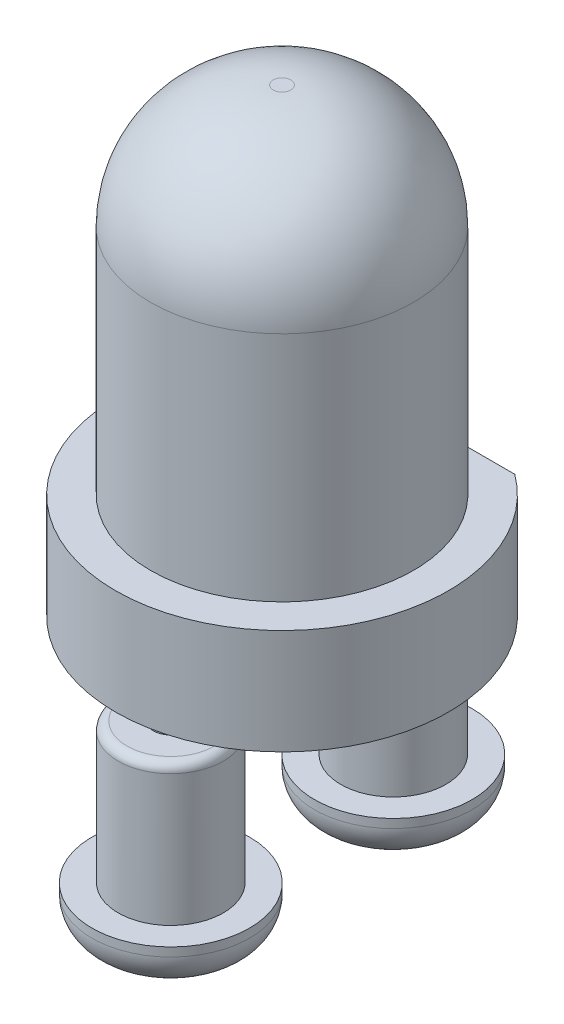
ISO-10303-21;
HEADER;
FILE_DESCRIPTION(('STEP AP214'),'2;1');
FILE_NAME('part.step','',(''),(''),'','','');
FILE_SCHEMA(('AUTOMOTIVE_DESIGN { 1 0 10303 214 1 1 1 1 }'));
ENDSEC;
DATA;
#1=APPLICATION_CONTEXT('core data for automotive mechanical design processes');
#2=APPLICATION_PROTOCOL_DEFINITION('international standard','automotive_design',2000,#1);
#3=PRODUCT_CONTEXT('',#1,'mechanical');
#4=PRODUCT('Part','Part','',(#3));
#5=PRODUCT_RELATED_PRODUCT_CATEGORY('part','',(#4));
#6=PRODUCT_DEFINITION_FORMATION('','',#4);
#7=PRODUCT_DEFINITION_CONTEXT('part definition',#1,'design');
#8=PRODUCT_DEFINITION('design','',#6,#7);
#9=PRODUCT_DEFINITION_SHAPE('','',#8);
#10=(LENGTH_UNIT() NAMED_UNIT(*) SI_UNIT(.MILLI.,.METRE.));
#11=(NAMED_UNIT(*) PLANE_ANGLE_UNIT() SI_UNIT($,.RADIAN.));
#12=(NAMED_UNIT(*) SI_UNIT($,.STERADIAN.) SOLID_ANGLE_UNIT());
#13=UNCERTAINTY_MEASURE_WITH_UNIT(LENGTH_MEASURE(1.E-05),#10,'distance_accuracy_value','');
#14=(GEOMETRIC_REPRESENTATION_CONTEXT(3) GLOBAL_UNCERTAINTY_ASSIGNED_CONTEXT((#13)) GLOBAL_UNIT_ASSIGNED_CONTEXT((#10,
#11,#12)) REPRESENTATION_CONTEXT('',''));
#15=CARTESIAN_POINT('',(0.,0.,0.));
#16=DIRECTION('',(0.,0.,1.));
#17=DIRECTION('',(1.,0.,0.));
#18=AXIS2_PLACEMENT_3D('',#15,#16,#17);
#19=CARTESIAN_POINT('',(0.,0.,0.));
#20=DIRECTION('',(0.,-1.,0.));
#21=DIRECTION('',(0.,0.,-1.));
#22=AXIS2_PLACEMENT_3D('',#19,#20,#21);
#23=PLANE('',#22);
#24=CARTESIAN_POINT('',(0.,0.,-1.27));
#25=DIRECTION('',(0.,-1.,0.));
#26=DIRECTION('',(0.,0.,-1.));
#27=AXIS2_PLACEMENT_3D('',#24,#25,#26);
#28=CIRCLE('',#27,0.2);
#29=CARTESIAN_POINT('',(0.,0.,-1.47));
#30=VERTEX_POINT('',#29);
#31=EDGE_CURVE('E174',#30,#30,#28,.T.);
#32=ORIENTED_EDGE('',*,*,#31,.F.);
#33=EDGE_LOOP('',(#32));
#34=FACE_BOUND('',#33,.T.);
#35=CARTESIAN_POINT('',(0.,0.,1.27));
#36=DIRECTION('',(0.,-1.,0.));
#37=DIRECTION('',(0.,0.,-1.));
#38=AXIS2_PLACEMENT_3D('',#35,#36,#37);
#39=CIRCLE('',#38,0.2);
#40=CARTESIAN_POINT('',(0.,0.,1.07));
#41=VERTEX_POINT('',#40);
#42=EDGE_CURVE('E177',#41,#41,#39,.T.);
#43=ORIENTED_EDGE('',*,*,#42,.F.);
#44=EDGE_LOOP('',(#43));
#45=FACE_BOUND('',#44,.T.);
#46=DIRECTION('',(1.,0.,0.));
#47=VECTOR('',#46,1.);
#48=CARTESIAN_POINT('',(-1.5,0.,-1.53));
#49=LINE('',#48,#47);
#50=CARTESIAN_POINT('',(-1.12654338576018,0.,-1.53));
#51=VERTEX_POINT('',#50);
#52=CARTESIAN_POINT('',(1.12654338576017,0.,-1.53));
#53=VERTEX_POINT('',#52);
#54=EDGE_CURVE('E59',#51,#53,#49,.T.);
#55=ORIENTED_EDGE('',*,*,#54,.T.);
#56=CARTESIAN_POINT('',(0.,0.,0.));
#57=DIRECTION('',(0.,-1.,0.));
#58=DIRECTION('',(0.,0.,-1.));
#59=AXIS2_PLACEMENT_3D('',#56,#57,#58);
#60=CIRCLE('',#59,1.9);
#61=EDGE_CURVE('E65',#53,#51,#60,.T.);
#62=ORIENTED_EDGE('',*,*,#61,.T.);
#63=EDGE_LOOP('',(#55,#62));
#64=FACE_BOUND('',#63,.T.);
#65=ADVANCED_FACE('F34',(#34,#45,#64),#23,.T.);
#66=CARTESIAN_POINT('',(0.1,5.25,0.));
#67=DIRECTION('',(0.,1.,0.));
#68=DIRECTION('',(0.,0.,1.));
#69=AXIS2_PLACEMENT_3D('',#66,#67,#68);
#70=PLANE('',#69);
#71=CARTESIAN_POINT('',(0.,5.25,0.));
#72=DIRECTION('',(0.,-1.,0.));
#73=DIRECTION('',(0.,0.,-1.));
#74=AXIS2_PLACEMENT_3D('',#71,#72,#73);
#75=CIRCLE('',#74,0.1);
#76=CARTESIAN_POINT('',(0.,5.25,-0.1));
#77=VERTEX_POINT('',#76);
#78=EDGE_CURVE('E84',#77,#77,#75,.T.);
#79=ORIENTED_EDGE('',*,*,#78,.F.);
#80=EDGE_LOOP('',(#79));
#81=FACE_BOUND('',#80,.T.);
#82=ADVANCED_FACE('F133',(#81),#70,.T.);
#83=CARTESIAN_POINT('',(0.,3.85,0.));
#84=DIRECTION('',(0.,-1.,0.));
#85=DIRECTION('',(0.,0.,-1.));
#86=AXIS2_PLACEMENT_3D('',#83,#84,#85);
#87=DEGENERATE_TOROIDAL_SURFACE('',#86,0.1,1.4,.T.);
#88=ORIENTED_EDGE('',*,*,#78,.T.);
#89=EDGE_LOOP('',(#88));
#90=FACE_BOUND('',#89,.T.);
#91=CARTESIAN_POINT('',(0.,3.85,0.));
#92=DIRECTION('',(0.,-1.,0.));
#93=DIRECTION('',(0.,0.,-1.));
#94=AXIS2_PLACEMENT_3D('',#91,#92,#93);
#95=CIRCLE('',#94,1.5);
#96=CARTESIAN_POINT('',(0.,3.85,-1.5));
#97=VERTEX_POINT('',#96);
#98=EDGE_CURVE('E81',#97,#97,#95,.T.);
#99=ORIENTED_EDGE('',*,*,#98,.F.);
#100=EDGE_LOOP('',(#99));
#101=FACE_BOUND('',#100,.T.);
#102=ADVANCED_FACE('F139',(#90,#101),#87,.T.);
#103=CARTESIAN_POINT('',(0.,0.,0.));
#104=DIRECTION('',(0.,-1.,0.));
#105=DIRECTION('',(0.,0.,-1.));
#106=AXIS2_PLACEMENT_3D('',#103,#104,#105);
#107=CYLINDRICAL_SURFACE('',#106,1.5);
#108=ORIENTED_EDGE('',*,*,#98,.T.);
#109=EDGE_LOOP('',(#108));
#110=FACE_BOUND('',#109,.T.);
#111=CARTESIAN_POINT('',(0.,1.2,0.));
#112=DIRECTION('',(0.,-1.,0.));
#113=DIRECTION('',(0.,0.,-1.));
#114=AXIS2_PLACEMENT_3D('',#111,#112,#113);
#115=CIRCLE('',#114,1.5);
#116=CARTESIAN_POINT('',(0.,1.2,-1.5));
#117=VERTEX_POINT('',#116);
#118=EDGE_CURVE('E75',#117,#117,#115,.T.);
#119=ORIENTED_EDGE('',*,*,#118,.F.);
#120=EDGE_LOOP('',(#119));
#121=FACE_BOUND('',#120,.T.);
#122=ADVANCED_FACE('F204',(#110,#121),#107,.T.);
#123=CARTESIAN_POINT('',(1.9,1.2,0.));
#124=DIRECTION('',(0.,1.,0.));
#125=DIRECTION('',(0.,0.,1.));
#126=AXIS2_PLACEMENT_3D('',#123,#124,#125);
#127=PLANE('',#126);
#128=DIRECTION('',(1.,0.,0.));
#129=VECTOR('',#128,1.);
#130=CARTESIAN_POINT('',(-1.5,1.2,-1.53));
#131=LINE('',#130,#129);
#132=CARTESIAN_POINT('',(-1.12654338576018,1.2,-1.53));
#133=VERTEX_POINT('',#132);
#134=CARTESIAN_POINT('',(1.12654338576018,1.2,-1.53));
#135=VERTEX_POINT('',#134);
#136=EDGE_CURVE('E49',#133,#135,#131,.T.);
#137=ORIENTED_EDGE('',*,*,#136,.F.);
#138=CARTESIAN_POINT('',(0.,1.2,0.));
#139=DIRECTION('',(0.,-1.,0.));
#140=DIRECTION('',(0.,0.,-1.));
#141=AXIS2_PLACEMENT_3D('',#138,#139,#140);
#142=CIRCLE('',#141,1.9);
#143=EDGE_CURVE('E71',#135,#133,#142,.T.);
#144=ORIENTED_EDGE('',*,*,#143,.F.);
#145=EDGE_LOOP('',(#137,#144));
#146=FACE_BOUND('',#145,.T.);
#147=ORIENTED_EDGE('',*,*,#118,.T.);
#148=EDGE_LOOP('',(#147));
#149=FACE_BOUND('',#148,.T.);
#150=ADVANCED_FACE('F201',(#146,#149),#127,.T.);
#151=CARTESIAN_POINT('',(0.,0.,0.));
#152=DIRECTION('',(0.,-1.,0.));
#153=DIRECTION('',(0.,0.,-1.));
#154=AXIS2_PLACEMENT_3D('',#151,#152,#153);
#155=CYLINDRICAL_SURFACE('',#154,1.9);
#156=DIRECTION('',(0.,-1.,0.));
#157=VECTOR('',#156,1.);
#158=CARTESIAN_POINT('',(-1.12654338576018,0.,-1.53));
#159=LINE('',#158,#157);
#160=EDGE_CURVE('E54',#51,#133,#159,.F.);
#161=ORIENTED_EDGE('',*,*,#160,.F.);
#162=ORIENTED_EDGE('',*,*,#61,.F.);
#163=DIRECTION('',(0.,-1.,0.));
#164=VECTOR('',#163,1.);
#165=CARTESIAN_POINT('',(1.12654338576018,0.,-1.53));
#166=LINE('',#165,#164);
#167=EDGE_CURVE('E61',#135,#53,#166,.T.);
#168=ORIENTED_EDGE('',*,*,#167,.F.);
#169=ORIENTED_EDGE('',*,*,#143,.T.);
#170=EDGE_LOOP('',(#161,#162,#168,#169));
#171=FACE_BOUND('',#170,.T.);
#172=ADVANCED_FACE('F69',(#171),#155,.T.);
#173=CARTESIAN_POINT('',(-1.5,-3.04138126514911,-1.53));
#174=DIRECTION('',(0.,0.,1.));
#175=DIRECTION('',(1.,0.,0.));
#176=AXIS2_PLACEMENT_3D('',#173,#174,#175);
#177=PLANE('',#176);
#178=ORIENTED_EDGE('',*,*,#160,.T.);
#179=ORIENTED_EDGE('',*,*,#136,.T.);
#180=ORIENTED_EDGE('',*,*,#167,.T.);
#181=ORIENTED_EDGE('',*,*,#54,.F.);
#182=EDGE_LOOP('',(#178,#179,#180,#181));
#183=FACE_BOUND('',#182,.T.);
#184=ADVANCED_FACE('F60',(#183),#177,.F.);
#185=CARTESIAN_POINT('',(0.,-17.5,1.27));
#186=DIRECTION('',(0.,1.,0.));
#187=DIRECTION('',(0.,0.,1.));
#188=AXIS2_PLACEMENT_3D('',#185,#186,#187);
#189=CYLINDRICAL_SURFACE('',#188,0.2);
#190=CARTESIAN_POINT('',(0.,-0.400000000000001,1.27));
#191=DIRECTION('',(0.,1.,0.));
#192=DIRECTION('',(0.,0.,1.));
#193=AXIS2_PLACEMENT_3D('',#190,#191,#192);
#194=CIRCLE('',#193,0.2);
#195=CARTESIAN_POINT('',(0.,-0.400000000000001,1.47));
#196=VERTEX_POINT('',#195);
#197=EDGE_CURVE('E103',#196,#196,#194,.T.);
#198=ORIENTED_EDGE('',*,*,#197,.T.);
#199=EDGE_LOOP('',(#198));
#200=FACE_BOUND('',#199,.T.);
#201=ORIENTED_EDGE('',*,*,#42,.T.);
#202=EDGE_LOOP('',(#201));
#203=FACE_BOUND('',#202,.T.);
#204=ADVANCED_FACE('F185',(#200,#203),#189,.T.);
#205=CARTESIAN_POINT('',(0.,-17.5,-1.27));
#206=DIRECTION('',(0.,1.,0.));
#207=DIRECTION('',(0.,0.,1.));
#208=AXIS2_PLACEMENT_3D('',#205,#206,#207);
#209=CYLINDRICAL_SURFACE('',#208,0.2);
#210=CARTESIAN_POINT('',(0.,-0.400000000000001,-1.27));
#211=DIRECTION('',(0.,1.,0.));
#212=DIRECTION('',(0.,0.,1.));
#213=AXIS2_PLACEMENT_3D('',#210,#211,#212);
#214=CIRCLE('',#213,0.2);
#215=CARTESIAN_POINT('',(0.,-0.400000000000001,-1.07));
#216=VERTEX_POINT('',#215);
#217=EDGE_CURVE('E107',#216,#216,#214,.T.);
#218=ORIENTED_EDGE('',*,*,#217,.T.);
#219=EDGE_LOOP('',(#218));
#220=FACE_BOUND('',#219,.T.);
#221=ORIENTED_EDGE('',*,*,#31,.T.);
#222=EDGE_LOOP('',(#221));
#223=FACE_BOUND('',#222,.T.);
#224=ADVANCED_FACE('F187',(#220,#223),#209,.T.);
#225=CARTESIAN_POINT('',(0.,-0.4,1.27));
#226=DIRECTION('',(0.,-1.,0.));
#227=DIRECTION('',(0.,0.,-1.));
#228=AXIS2_PLACEMENT_3D('',#225,#226,#227);
#229=CYLINDRICAL_SURFACE('',#228,0.6);
#230=CARTESIAN_POINT('',(0.,-0.5,1.27));
#231=DIRECTION('',(0.,1.,0.));
#232=DIRECTION('',(0.,0.,1.));
#233=AXIS2_PLACEMENT_3D('',#230,#231,#232);
#234=CIRCLE('',#233,0.6);
#235=CARTESIAN_POINT('',(0.,-0.5,1.87));
#236=VERTEX_POINT('',#235);
#237=EDGE_CURVE('E11',#236,#236,#234,.F.);
#238=ORIENTED_EDGE('',*,*,#237,.T.);
#239=EDGE_LOOP('',(#238));
#240=FACE_BOUND('',#239,.T.);
#241=CARTESIAN_POINT('',(0.,-2.,1.27));
#242=DIRECTION('',(0.,-1.,0.));
#243=DIRECTION('',(0.,0.,-1.));
#244=AXIS2_PLACEMENT_3D('',#241,#242,#243);
#245=CIRCLE('',#244,0.6);
#246=CARTESIAN_POINT('',(0.,-2.,0.67));
#247=VERTEX_POINT('',#246);
#248=EDGE_CURVE('E99',#247,#247,#245,.F.);
#249=ORIENTED_EDGE('',*,*,#248,.T.);
#250=EDGE_LOOP('',(#249));
#251=FACE_BOUND('',#250,.T.);
#252=ADVANCED_FACE('F194',(#240,#251),#229,.T.);
#253=CARTESIAN_POINT('',(0.,-0.4,1.27));
#254=DIRECTION('',(0.,1.,0.));
#255=DIRECTION('',(0.,0.,1.));
#256=AXIS2_PLACEMENT_3D('',#253,#254,#255);
#257=PLANE('',#256);
#258=CARTESIAN_POINT('',(0.,-0.4,1.27));
#259=DIRECTION('',(0.,1.,0.));
#260=DIRECTION('',(0.,0.,1.));
#261=AXIS2_PLACEMENT_3D('',#258,#259,#260);
#262=CIRCLE('',#261,0.5);
#263=CARTESIAN_POINT('',(0.,-0.4,1.77));
#264=VERTEX_POINT('',#263);
#265=EDGE_CURVE('E42',#264,#264,#262,.T.);
#266=ORIENTED_EDGE('',*,*,#265,.T.);
#267=EDGE_LOOP('',(#266));
#268=FACE_BOUND('',#267,.T.);
#269=ORIENTED_EDGE('',*,*,#197,.F.);
#270=EDGE_LOOP('',(#269));
#271=FACE_BOUND('',#270,.T.);
#272=ADVANCED_FACE('F120',(#268,#271),#257,.T.);
#273=CARTESIAN_POINT('',(0.,-2.5,1.27));
#274=DIRECTION('',(0.,-1.,0.));
#275=DIRECTION('',(0.,0.,-1.));
#276=AXIS2_PLACEMENT_3D('',#273,#274,#275);
#277=PLANE('',#276);
#278=CARTESIAN_POINT('',(0.,-2.5,1.27));
#279=DIRECTION('',(0.,-1.,0.));
#280=DIRECTION('',(0.,0.,-1.));
#281=AXIS2_PLACEMENT_3D('',#278,#279,#280);
#282=CIRCLE('',#281,0.5);
#283=CARTESIAN_POINT('',(0.,-2.5,0.77));
#284=VERTEX_POINT('',#283);
#285=EDGE_CURVE('E93',#284,#284,#282,.T.);
#286=ORIENTED_EDGE('',*,*,#285,.T.);
#287=EDGE_LOOP('',(#286));
#288=FACE_BOUND('',#287,.T.);
#289=ADVANCED_FACE('F155',(#288),#277,.T.);
#290=CARTESIAN_POINT('',(0.,-2.1,1.27));
#291=DIRECTION('',(0.,-1.,0.));
#292=DIRECTION('',(0.,0.,-1.));
#293=AXIS2_PLACEMENT_3D('',#290,#291,#292);
#294=TOROIDAL_SURFACE('',#293,0.5,0.4);
#295=CARTESIAN_POINT('',(0.,-2.1,1.27));
#296=DIRECTION('',(0.,-1.,0.));
#297=DIRECTION('',(0.,0.,-1.));
#298=AXIS2_PLACEMENT_3D('',#295,#296,#297);
#299=CIRCLE('',#298,0.9);
#300=CARTESIAN_POINT('',(0.,-2.1,0.37));
#301=VERTEX_POINT('',#300);
#302=EDGE_CURVE('E96',#301,#301,#299,.F.);
#303=ORIENTED_EDGE('',*,*,#302,.F.);
#304=EDGE_LOOP('',(#303));
#305=FACE_BOUND('',#304,.T.);
#306=ORIENTED_EDGE('',*,*,#285,.F.);
#307=EDGE_LOOP('',(#306));
#308=FACE_BOUND('',#307,.T.);
#309=ADVANCED_FACE('F152',(#305,#308),#294,.T.);
#310=CARTESIAN_POINT('',(0.,-2.5,1.27));
#311=DIRECTION('',(0.,1.,0.));
#312=DIRECTION('',(0.,0.,1.));
#313=AXIS2_PLACEMENT_3D('',#310,#311,#312);
#314=CYLINDRICAL_SURFACE('',#313,0.9);
#315=ORIENTED_EDGE('',*,*,#302,.T.);
#316=EDGE_LOOP('',(#315));
#317=FACE_BOUND('',#316,.T.);
#318=CARTESIAN_POINT('',(0.,-2.,1.27));
#319=DIRECTION('',(0.,-1.,0.));
#320=DIRECTION('',(0.,0.,-1.));
#321=AXIS2_PLACEMENT_3D('',#318,#319,#320);
#322=CIRCLE('',#321,0.9);
#323=CARTESIAN_POINT('',(0.,-2.,0.37));
#324=VERTEX_POINT('',#323);
#325=EDGE_CURVE('E172',#324,#324,#322,.T.);
#326=ORIENTED_EDGE('',*,*,#325,.T.);
#327=EDGE_LOOP('',(#326));
#328=FACE_BOUND('',#327,.T.);
#329=ADVANCED_FACE('F154',(#317,#328),#314,.T.);
#330=CARTESIAN_POINT('',(0.,-2.,1.27));
#331=DIRECTION('',(0.,-1.,0.));
#332=DIRECTION('',(0.,0.,-1.));
#333=AXIS2_PLACEMENT_3D('',#330,#331,#332);
#334=PLANE('',#333);
#335=ORIENTED_EDGE('',*,*,#248,.F.);
#336=EDGE_LOOP('',(#335));
#337=FACE_BOUND('',#336,.T.);
#338=ORIENTED_EDGE('',*,*,#325,.F.);
#339=EDGE_LOOP('',(#338));
#340=FACE_BOUND('',#339,.T.);
#341=ADVANCED_FACE('F161',(#337,#340),#334,.F.);
#342=CARTESIAN_POINT('',(0.,-0.4,-1.27));
#343=DIRECTION('',(0.,-1.,0.));
#344=DIRECTION('',(0.,0.,-1.));
#345=AXIS2_PLACEMENT_3D('',#342,#343,#344);
#346=CYLINDRICAL_SURFACE('',#345,0.6);
#347=CARTESIAN_POINT('',(0.,-0.5,-1.27));
#348=DIRECTION('',(0.,1.,0.));
#349=DIRECTION('',(0.,0.,1.));
#350=AXIS2_PLACEMENT_3D('',#347,#348,#349);
#351=CIRCLE('',#350,0.6);
#352=CARTESIAN_POINT('',(0.,-0.5,-0.67));
#353=VERTEX_POINT('',#352);
#354=EDGE_CURVE('E115',#353,#353,#351,.F.);
#355=ORIENTED_EDGE('',*,*,#354,.T.);
#356=EDGE_LOOP('',(#355));
#357=FACE_BOUND('',#356,.T.);
#358=CARTESIAN_POINT('',(0.,-2.,-1.27));
#359=DIRECTION('',(0.,-1.,0.));
#360=DIRECTION('',(0.,0.,-1.));
#361=AXIS2_PLACEMENT_3D('',#358,#359,#360);
#362=CIRCLE('',#361,0.6);
#363=CARTESIAN_POINT('',(0.,-2.,-1.87));
#364=VERTEX_POINT('',#363);
#365=EDGE_CURVE('E102',#364,#364,#362,.F.);
#366=ORIENTED_EDGE('',*,*,#365,.T.);
#367=EDGE_LOOP('',(#366));
#368=FACE_BOUND('',#367,.T.);
#369=ADVANCED_FACE('F308',(#357,#368),#346,.T.);
#370=CARTESIAN_POINT('',(0.,-0.4,-1.27));
#371=DIRECTION('',(0.,1.,0.));
#372=DIRECTION('',(0.,0.,1.));
#373=AXIS2_PLACEMENT_3D('',#370,#371,#372);
#374=PLANE('',#373);
#375=CARTESIAN_POINT('',(0.,-0.4,-1.27));
#376=DIRECTION('',(0.,1.,0.));
#377=DIRECTION('',(0.,0.,1.));
#378=AXIS2_PLACEMENT_3D('',#375,#376,#377);
#379=CIRCLE('',#378,0.5);
#380=CARTESIAN_POINT('',(0.,-0.4,-0.77));
#381=VERTEX_POINT('',#380);
#382=EDGE_CURVE('E110',#381,#381,#379,.T.);
#383=ORIENTED_EDGE('',*,*,#382,.T.);
#384=EDGE_LOOP('',(#383));
#385=FACE_BOUND('',#384,.T.);
#386=ORIENTED_EDGE('',*,*,#217,.F.);
#387=EDGE_LOOP('',(#386));
#388=FACE_BOUND('',#387,.T.);
#389=ADVANCED_FACE('F277',(#385,#388),#374,.T.);
#390=CARTESIAN_POINT('',(0.,-2.5,-1.27));
#391=DIRECTION('',(0.,-1.,0.));
#392=DIRECTION('',(0.,0.,-1.));
#393=AXIS2_PLACEMENT_3D('',#390,#391,#392);
#394=PLANE('',#393);
#395=CARTESIAN_POINT('',(0.,-2.5,-1.27));
#396=DIRECTION('',(0.,-1.,0.));
#397=DIRECTION('',(0.,0.,-1.));
#398=AXIS2_PLACEMENT_3D('',#395,#396,#397);
#399=CIRCLE('',#398,0.5);
#400=CARTESIAN_POINT('',(0.,-2.5,-1.77));
#401=VERTEX_POINT('',#400);
#402=EDGE_CURVE('E72',#401,#401,#399,.T.);
#403=ORIENTED_EDGE('',*,*,#402,.T.);
#404=EDGE_LOOP('',(#403));
#405=FACE_BOUND('',#404,.T.);
#406=ADVANCED_FACE('F150',(#405),#394,.T.);
#407=CARTESIAN_POINT('',(0.,-2.1,-1.27));
#408=DIRECTION('',(0.,-1.,0.));
#409=DIRECTION('',(0.,0.,-1.));
#410=AXIS2_PLACEMENT_3D('',#407,#408,#409);
#411=TOROIDAL_SURFACE('',#410,0.5,0.4);
#412=CARTESIAN_POINT('',(0.,-2.1,-1.27));
#413=DIRECTION('',(0.,-1.,0.));
#414=DIRECTION('',(0.,0.,-1.));
#415=AXIS2_PLACEMENT_3D('',#412,#413,#414);
#416=CIRCLE('',#415,0.9);
#417=CARTESIAN_POINT('',(0.,-2.1,-2.17));
#418=VERTEX_POINT('',#417);
#419=EDGE_CURVE('E90',#418,#418,#416,.F.);
#420=ORIENTED_EDGE('',*,*,#419,.F.);
#421=EDGE_LOOP('',(#420));
#422=FACE_BOUND('',#421,.T.);
#423=ORIENTED_EDGE('',*,*,#402,.F.);
#424=EDGE_LOOP('',(#423));
#425=FACE_BOUND('',#424,.T.);
#426=ADVANCED_FACE('F146',(#422,#425),#411,.T.);
#427=CARTESIAN_POINT('',(0.,-2.5,-1.27));
#428=DIRECTION('',(0.,1.,0.));
#429=DIRECTION('',(0.,0.,1.));
#430=AXIS2_PLACEMENT_3D('',#427,#428,#429);
#431=CYLINDRICAL_SURFACE('',#430,0.9);
#432=ORIENTED_EDGE('',*,*,#419,.T.);
#433=EDGE_LOOP('',(#432));
#434=FACE_BOUND('',#433,.T.);
#435=CARTESIAN_POINT('',(0.,-2.,-1.27));
#436=DIRECTION('',(0.,-1.,0.));
#437=DIRECTION('',(0.,0.,-1.));
#438=AXIS2_PLACEMENT_3D('',#435,#436,#437);
#439=CIRCLE('',#438,0.9);
#440=CARTESIAN_POINT('',(0.,-2.,-2.17));
#441=VERTEX_POINT('',#440);
#442=EDGE_CURVE('E106',#441,#441,#439,.T.);
#443=ORIENTED_EDGE('',*,*,#442,.T.);
#444=EDGE_LOOP('',(#443));
#445=FACE_BOUND('',#444,.T.);
#446=ADVANCED_FACE('F149',(#434,#445),#431,.T.);
#447=CARTESIAN_POINT('',(0.,-2.,-1.27));
#448=DIRECTION('',(0.,-1.,0.));
#449=DIRECTION('',(0.,0.,-1.));
#450=AXIS2_PLACEMENT_3D('',#447,#448,#449);
#451=PLANE('',#450);
#452=ORIENTED_EDGE('',*,*,#365,.F.);
#453=EDGE_LOOP('',(#452));
#454=FACE_BOUND('',#453,.T.);
#455=ORIENTED_EDGE('',*,*,#442,.F.);
#456=EDGE_LOOP('',(#455));
#457=FACE_BOUND('',#456,.T.);
#458=ADVANCED_FACE('F129',(#454,#457),#451,.F.);
#459=CARTESIAN_POINT('',(0.,-0.5,-1.27));
#460=DIRECTION('',(0.,1.,0.));
#461=DIRECTION('',(0.,0.,1.));
#462=AXIS2_PLACEMENT_3D('',#459,#460,#461);
#463=TOROIDAL_SURFACE('',#462,0.5,0.1);
#464=ORIENTED_EDGE('',*,*,#354,.F.);
#465=EDGE_LOOP('',(#464));
#466=FACE_BOUND('',#465,.T.);
#467=ORIENTED_EDGE('',*,*,#382,.F.);
#468=EDGE_LOOP('',(#467));
#469=FACE_BOUND('',#468,.T.);
#470=ADVANCED_FACE('F124',(#466,#469),#463,.T.);
#471=CARTESIAN_POINT('',(0.,-0.5,1.27));
#472=DIRECTION('',(0.,1.,0.));
#473=DIRECTION('',(0.,0.,1.));
#474=AXIS2_PLACEMENT_3D('',#471,#472,#473);
#475=TOROIDAL_SURFACE('',#474,0.5,0.1);
#476=ORIENTED_EDGE('',*,*,#237,.F.);
#477=EDGE_LOOP('',(#476));
#478=FACE_BOUND('',#477,.T.);
#479=ORIENTED_EDGE('',*,*,#265,.F.);
#480=EDGE_LOOP('',(#479));
#481=FACE_BOUND('',#480,.T.);
#482=ADVANCED_FACE('F36',(#478,#481),#475,.T.);
#483=CLOSED_SHELL('',(#65,#82,#102,#122,#150,#172,#184,#204,#224,#252,#272,#289,#309,#329,#341,
#369,#389,#406,#426,#446,#458,#470,#482));
#484=MANIFOLD_SOLID_BREP('B2',#483);
#485=ADVANCED_BREP_SHAPE_REPRESENTATION('',(#18,#484),#14);
#486=SHAPE_DEFINITION_REPRESENTATION(#9,#485);
ENDSEC;
END-ISO-10303-21;
